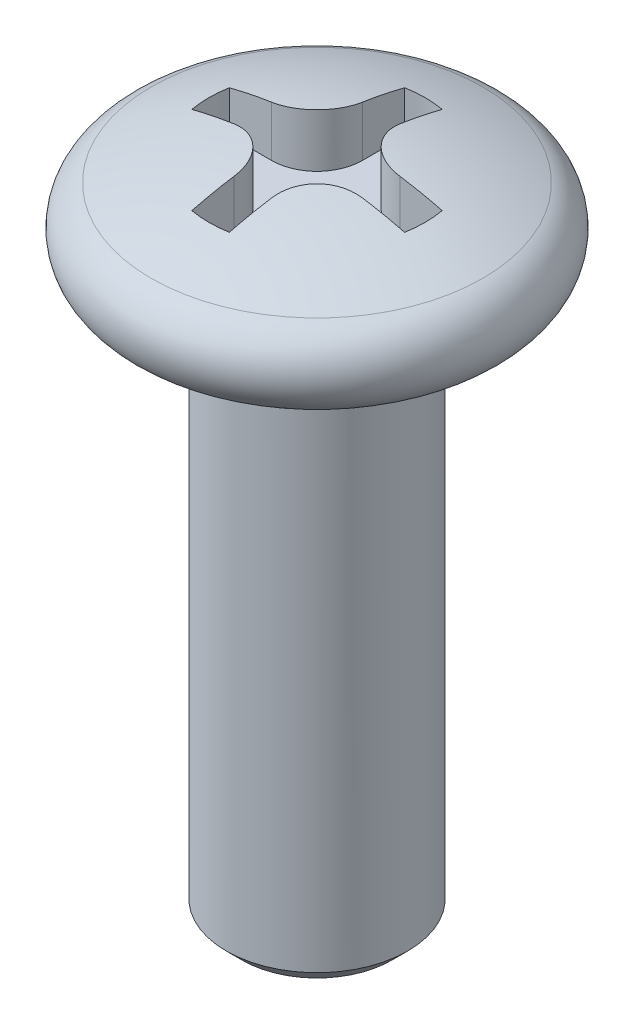
ISO-10303-21;
HEADER;
FILE_DESCRIPTION(('STEP AP214'),'2;1');
FILE_NAME('part.step','',(''),(''),'','','');
FILE_SCHEMA(('AUTOMOTIVE_DESIGN { 1 0 10303 214 1 1 1 1 }'));
ENDSEC;
DATA;
#1=APPLICATION_CONTEXT('core data for automotive mechanical design processes');
#2=APPLICATION_PROTOCOL_DEFINITION('international standard','automotive_design',2000,#1);
#3=PRODUCT_CONTEXT('',#1,'mechanical');
#4=PRODUCT('Part','Part','',(#3));
#5=PRODUCT_RELATED_PRODUCT_CATEGORY('part','',(#4));
#6=PRODUCT_DEFINITION_FORMATION('','',#4);
#7=PRODUCT_DEFINITION_CONTEXT('part definition',#1,'design');
#8=PRODUCT_DEFINITION('design','',#6,#7);
#9=PRODUCT_DEFINITION_SHAPE('','',#8);
#10=(LENGTH_UNIT() NAMED_UNIT(*) SI_UNIT(.MILLI.,.METRE.));
#11=(NAMED_UNIT(*) PLANE_ANGLE_UNIT() SI_UNIT($,.RADIAN.));
#12=(NAMED_UNIT(*) SI_UNIT($,.STERADIAN.) SOLID_ANGLE_UNIT());
#13=UNCERTAINTY_MEASURE_WITH_UNIT(LENGTH_MEASURE(1.E-05),#10,'distance_accuracy_value','');
#14=(GEOMETRIC_REPRESENTATION_CONTEXT(3) GLOBAL_UNCERTAINTY_ASSIGNED_CONTEXT((#13)) GLOBAL_UNIT_ASSIGNED_CONTEXT((#10,
#11,#12)) REPRESENTATION_CONTEXT('',''));
#15=CARTESIAN_POINT('',(0.,0.,0.));
#16=DIRECTION('',(0.,0.,1.));
#17=DIRECTION('',(1.,0.,0.));
#18=AXIS2_PLACEMENT_3D('',#15,#16,#17);
#19=CARTESIAN_POINT('',(0.,0.8,0.));
#20=DIRECTION('',(0.,-1.,0.));
#21=DIRECTION('',(0.,0.,-1.));
#22=AXIS2_PLACEMENT_3D('',#19,#20,#21);
#23=PLANE('',#22);
#24=DIRECTION('',(0.,0.,1.));
#25=VECTOR('',#24,1.);
#26=CARTESIAN_POINT('',(-0.2692388155425,0.8,1.526437178598));
#27=LINE('',#26,#25);
#28=CARTESIAN_POINT('',(-0.2692388155425,0.8,0.9192388155425));
#29=VERTEX_POINT('',#28);
#30=CARTESIAN_POINT('',(-0.2692388155425,0.8,1.52643732965034));
#31=VERTEX_POINT('',#30);
#32=EDGE_CURVE('E161',#29,#31,#27,.T.);
#33=ORIENTED_EDGE('',*,*,#32,.T.);
#34=CARTESIAN_POINT('',(0.,0.8,0.));
#35=DIRECTION('',(0.,-1.,0.));
#36=DIRECTION('',(0.,0.,-1.));
#37=AXIS2_PLACEMENT_3D('',#34,#35,#36);
#38=CIRCLE('',#37,1.55);
#39=CARTESIAN_POINT('',(0.269238815542473,0.8,1.52643717859769));
#40=VERTEX_POINT('',#39);
#41=EDGE_CURVE('E238',#31,#40,#38,.F.);
#42=ORIENTED_EDGE('',*,*,#41,.T.);
#43=DIRECTION('',(0.,0.,-1.));
#44=VECTOR('',#43,1.);
#45=CARTESIAN_POINT('',(0.2692388155425,0.8,0.9192388155425));
#46=LINE('',#45,#44);
#47=CARTESIAN_POINT('',(0.2692388155425,0.8,0.9192388155425));
#48=VERTEX_POINT('',#47);
#49=EDGE_CURVE('E165',#40,#48,#46,.T.);
#50=ORIENTED_EDGE('',*,*,#49,.T.);
#51=CARTESIAN_POINT('',(0.9192388155425,0.8,0.9192388155425));
#52=DIRECTION('',(0.,-1.,0.));
#53=DIRECTION('',(0.,0.,-1.));
#54=AXIS2_PLACEMENT_3D('',#51,#52,#53);
#55=CIRCLE('',#54,0.65);
#56=CARTESIAN_POINT('',(0.9192388155425,0.8,0.2692388155425));
#57=VERTEX_POINT('',#56);
#58=EDGE_CURVE('E168',#57,#48,#55,.F.);
#59=ORIENTED_EDGE('',*,*,#58,.F.);
#60=DIRECTION('',(1.,0.,0.));
#61=VECTOR('',#60,1.);
#62=CARTESIAN_POINT('',(1.526437178598,0.8,0.2692388155425));
#63=LINE('',#62,#61);
#64=CARTESIAN_POINT('',(1.52643725449384,0.8,0.2692388155425));
#65=VERTEX_POINT('',#64);
#66=EDGE_CURVE('E169',#57,#65,#63,.T.);
#67=ORIENTED_EDGE('',*,*,#66,.T.);
#68=CARTESIAN_POINT('',(0.,0.8,0.));
#69=DIRECTION('',(0.,-1.,0.));
#70=DIRECTION('',(0.,0.,-1.));
#71=AXIS2_PLACEMENT_3D('',#68,#69,#70);
#72=CIRCLE('',#71,1.55);
#73=CARTESIAN_POINT('',(1.52643717859769,0.8,-0.269238815542473));
#74=VERTEX_POINT('',#73);
#75=EDGE_CURVE('E249',#65,#74,#72,.F.);
#76=ORIENTED_EDGE('',*,*,#75,.T.);
#77=DIRECTION('',(-1.,0.,0.));
#78=VECTOR('',#77,1.);
#79=CARTESIAN_POINT('',(0.9192388155425,0.8,-0.2692388155425));
#80=LINE('',#79,#78);
#81=CARTESIAN_POINT('',(0.9192388155425,0.8,-0.2692388155425));
#82=VERTEX_POINT('',#81);
#83=EDGE_CURVE('E174',#74,#82,#80,.T.);
#84=ORIENTED_EDGE('',*,*,#83,.T.);
#85=CARTESIAN_POINT('',(0.9192388155425,0.8,-0.9192388155425));
#86=DIRECTION('',(0.,-1.,0.));
#87=DIRECTION('',(0.,0.,-1.));
#88=AXIS2_PLACEMENT_3D('',#85,#86,#87);
#89=CIRCLE('',#88,0.65);
#90=CARTESIAN_POINT('',(0.2692388155425,0.8,-0.9192388155425));
#91=VERTEX_POINT('',#90);
#92=EDGE_CURVE('E177',#91,#82,#89,.F.);
#93=ORIENTED_EDGE('',*,*,#92,.F.);
#94=DIRECTION('',(0.,0.,-1.));
#95=VECTOR('',#94,1.);
#96=CARTESIAN_POINT('',(0.2692388155425,0.8,-1.526437178598));
#97=LINE('',#96,#95);
#98=CARTESIAN_POINT('',(0.2692388155425,0.8,-1.52643732965034));
#99=VERTEX_POINT('',#98);
#100=EDGE_CURVE('E179',#91,#99,#97,.T.);
#101=ORIENTED_EDGE('',*,*,#100,.T.);
#102=CARTESIAN_POINT('',(0.,0.8,0.));
#103=DIRECTION('',(0.,-1.,0.));
#104=DIRECTION('',(0.,0.,-1.));
#105=AXIS2_PLACEMENT_3D('',#102,#103,#104);
#106=CIRCLE('',#105,1.55);
#107=CARTESIAN_POINT('',(-0.269238815542474,0.8,-1.52643717859769));
#108=VERTEX_POINT('',#107);
#109=EDGE_CURVE('E137',#99,#108,#106,.F.);
#110=ORIENTED_EDGE('',*,*,#109,.T.);
#111=DIRECTION('',(0.,0.,1.));
#112=VECTOR('',#111,1.);
#113=CARTESIAN_POINT('',(-0.2692388155425,0.8,-0.9192388155425));
#114=LINE('',#113,#112);
#115=CARTESIAN_POINT('',(-0.2692388155425,0.8,-0.9192388155425));
#116=VERTEX_POINT('',#115);
#117=EDGE_CURVE('E133',#108,#116,#114,.T.);
#118=ORIENTED_EDGE('',*,*,#117,.T.);
#119=CARTESIAN_POINT('',(-0.9192388155425,0.8,-0.9192388155425));
#120=DIRECTION('',(0.,-1.,0.));
#121=DIRECTION('',(0.,0.,-1.));
#122=AXIS2_PLACEMENT_3D('',#119,#120,#121);
#123=CIRCLE('',#122,0.65);
#124=CARTESIAN_POINT('',(-0.9192388155425,0.8,-0.2692388155425));
#125=VERTEX_POINT('',#124);
#126=EDGE_CURVE('E20',#125,#116,#123,.F.);
#127=ORIENTED_EDGE('',*,*,#126,.F.);
#128=DIRECTION('',(-1.,0.,0.));
#129=VECTOR('',#128,1.);
#130=CARTESIAN_POINT('',(-1.526437178598,0.8,-0.2692388155425));
#131=LINE('',#130,#129);
#132=CARTESIAN_POINT('',(-1.5264371785977,0.8,-0.269238815542425));
#133=VERTEX_POINT('',#132);
#134=EDGE_CURVE('E128',#125,#133,#131,.T.);
#135=ORIENTED_EDGE('',*,*,#134,.T.);
#136=CARTESIAN_POINT('',(0.,0.8,0.));
#137=DIRECTION('',(0.,-1.,0.));
#138=DIRECTION('',(0.,0.,-1.));
#139=AXIS2_PLACEMENT_3D('',#136,#137,#138);
#140=CIRCLE('',#139,1.55);
#141=CARTESIAN_POINT('',(-1.52643717859784,0.8,0.2692388155425));
#142=VERTEX_POINT('',#141);
#143=EDGE_CURVE('E246',#133,#142,#140,.F.);
#144=ORIENTED_EDGE('',*,*,#143,.T.);
#145=DIRECTION('',(1.,0.,0.));
#146=VECTOR('',#145,1.);
#147=CARTESIAN_POINT('',(-0.9192388155425,0.8,0.2692388155425));
#148=LINE('',#147,#146);
#149=CARTESIAN_POINT('',(-0.9192388155425,0.8,0.2692388155425));
#150=VERTEX_POINT('',#149);
#151=EDGE_CURVE('E158',#142,#150,#148,.T.);
#152=ORIENTED_EDGE('',*,*,#151,.T.);
#153=CARTESIAN_POINT('',(-0.9192388155425,0.8,0.9192388155425));
#154=DIRECTION('',(0.,-1.,0.));
#155=DIRECTION('',(0.,0.,-1.));
#156=AXIS2_PLACEMENT_3D('',#153,#154,#155);
#157=CIRCLE('',#156,0.65);
#158=EDGE_CURVE('E232',#29,#150,#157,.F.);
#159=ORIENTED_EDGE('',*,*,#158,.F.);
#160=EDGE_LOOP('',(#33,#42,#50,#59,#67,#76,#84,#93,#101,#110,#118,#127,#135,#144,#152,#159));
#161=FACE_BOUND('',#160,.T.);
#162=ADVANCED_FACE('F17',(#161),#23,.F.);
#163=CARTESIAN_POINT('',(-1.526437178598,0.8,-0.2692388155425));
#164=DIRECTION('',(0.,0.,-1.));
#165=DIRECTION('',(-1.,0.,0.));
#166=AXIS2_PLACEMENT_3D('',#163,#164,#165);
#167=PLANE('',#166);
#168=ORIENTED_EDGE('',*,*,#134,.F.);
#169=DIRECTION('',(0.,-1.,0.));
#170=VECTOR('',#169,1.);
#171=CARTESIAN_POINT('',(-0.9192388155425,0.8,-0.2692388155425));
#172=LINE('',#171,#170);
#173=CARTESIAN_POINT('',(-0.919238815542485,1.5247137721749,-0.269238815542501));
#174=VERTEX_POINT('',#173);
#175=EDGE_CURVE('E147',#174,#125,#172,.T.);
#176=ORIENTED_EDGE('',*,*,#175,.F.);
#177=CARTESIAN_POINT('',(-1.52643717859785,1.40083405534686,-0.269238815542502));
#178=CARTESIAN_POINT('',(-1.42628258533272,1.42660341497324,-0.269238815542501));
#179=CARTESIAN_POINT('',(-1.32560542511221,1.44981140452209,-0.2692388155425));
#180=CARTESIAN_POINT('',(-1.12320597076041,1.49110464346474,-0.2692388155425));
#181=CARTESIAN_POINT('',(-1.02148367662913,1.50918989285854,-0.269238815542501));
#182=CARTESIAN_POINT('',(-0.919238815542471,1.52471377217481,-0.269238815542503));
#183=B_SPLINE_CURVE_WITH_KNOTS('',3,(#177,#178,#179,#180,#181,#182),.UNSPECIFIED.,.F.,.F.,(4,2,
4),(0.,0.309952435577942,0.619904871155884),.UNSPECIFIED.);
#184=CARTESIAN_POINT('',(-1.52643717859778,1.40083405534693,-0.269238815542426));
#185=VERTEX_POINT('',#184);
#186=EDGE_CURVE('E229',#185,#174,#183,.T.);
#187=ORIENTED_EDGE('',*,*,#186,.F.);
#188=DIRECTION('',(0.,-1.,0.));
#189=VECTOR('',#188,1.);
#190=CARTESIAN_POINT('',(-1.52643717859772,0.8,-0.269238815542349));
#191=LINE('',#190,#189);
#192=EDGE_CURVE('E244',#185,#133,#191,.T.);
#193=ORIENTED_EDGE('',*,*,#192,.T.);
#194=EDGE_LOOP('',(#168,#176,#187,#193));
#195=FACE_BOUND('',#194,.T.);
#196=ADVANCED_FACE('F287',(#195),#167,.F.);
#197=CARTESIAN_POINT('',(-0.9192388155425,0.8,-0.9192388155425));
#198=DIRECTION('',(0.,-1.,0.));
#199=DIRECTION('',(0.,0.,-1.));
#200=AXIS2_PLACEMENT_3D('',#197,#198,#199);
#201=CYLINDRICAL_SURFACE('',#200,0.65);
#202=DIRECTION('',(0.,1.,0.));
#203=VECTOR('',#202,1.);
#204=CARTESIAN_POINT('',(-0.2692388155425,0.8,-0.9192388155425));
#205=LINE('',#204,#203);
#206=CARTESIAN_POINT('',(-0.269238815542499,1.5247137721749,-0.9192388155425));
#207=VERTEX_POINT('',#206);
#208=EDGE_CURVE('E141',#116,#207,#205,.T.);
#209=ORIENTED_EDGE('',*,*,#208,.T.);
#210=CARTESIAN_POINT('',(-0.919238815542471,1.52471377217481,-0.269238815542502));
#211=CARTESIAN_POINT('',(-0.883271069284547,1.53017838215662,-0.269206596368221));
#212=CARTESIAN_POINT('',(-0.847230957030022,1.53518398680924,-0.272222835690411));
#213=CARTESIAN_POINT('',(-0.776024482266567,1.54415362187526,-0.284194183766013));
#214=CARTESIAN_POINT('',(-0.740857976412674,1.5481178242021,-0.293148311438722));
#215=CARTESIAN_POINT('',(-0.67237147630745,1.55488625546089,-0.316848960302737));
#216=CARTESIAN_POINT('',(-0.639053304502208,1.55768935656103,-0.331601086387425));
#217=CARTESIAN_POINT('',(-0.575297778798748,1.56204492956572,-0.366496760027211));
#218=CARTESIAN_POINT('',(-0.544859240050173,1.56359791783258,-0.386638076978003));
#219=CARTESIAN_POINT('',(-0.488097063461274,1.56539571440067,-0.431479043245953));
#220=CARTESIAN_POINT('',(-0.46172860298219,1.56565593228317,-0.456121349806758));
#221=CARTESIAN_POINT('',(-0.413435525795813,1.56490196217992,-0.509414647326526));
#222=CARTESIAN_POINT('',(-0.391510799474461,1.56388780563375,-0.538065539375813));
#223=CARTESIAN_POINT('',(-0.352825154531402,1.56062536432746,-0.598376464130783));
#224=CARTESIAN_POINT('',(-0.33603703253758,1.55838376285363,-0.630019440211363));
#225=CARTESIAN_POINT('',(-0.307904881496572,1.55273696196925,-0.69554063304805));
#226=CARTESIAN_POINT('',(-0.296559537832556,1.54933204387991,-0.729418307797173));
#227=CARTESIAN_POINT('',(-0.281799832125994,1.54249219211062,-0.789390970708275));
#228=CARTESIAN_POINT('',(-0.277087023520738,1.53929822937966,-0.815202930682549));
#229=CARTESIAN_POINT('',(-0.270805742102409,1.53238664939424,-0.867099473917435));
#230=CARTESIAN_POINT('',(-0.269232761212042,1.52866979112439,-0.893183612184108));
#231=CARTESIAN_POINT('',(-0.269238815542499,1.5247137721748,-0.919238815542471));
#232=B_SPLINE_CURVE_WITH_KNOTS('',3,(#210,#211,#212,#213,#214,#215,#216,#217,#218,#219,#220,
#221,#222,#223,#224,#225,#226,#227,#228,#229,#230,#231),.UNSPECIFIED.,.F.,.F.,(4,2,2,2,2,2,2,2,
2,2,4),(0.,0.109017930799935,0.218017853725243,0.327123406477721,0.436183869743588,
0.543941180487167,0.651695832846214,0.758869525629321,0.866017319256542,0.945129051904781,
1.02412711619082),.UNSPECIFIED.);
#233=EDGE_CURVE('E271',#174,#207,#232,.T.);
#234=ORIENTED_EDGE('',*,*,#233,.F.);
#235=ORIENTED_EDGE('',*,*,#175,.T.);
#236=ORIENTED_EDGE('',*,*,#126,.T.);
#237=EDGE_LOOP('',(#209,#234,#235,#236));
#238=FACE_BOUND('',#237,.T.);
#239=ADVANCED_FACE('F144',(#238),#201,.T.);
#240=CARTESIAN_POINT('',(-0.2692388155425,0.8,-0.9192388155425));
#241=DIRECTION('',(-1.,0.,0.));
#242=DIRECTION('',(0.,0.,1.));
#243=AXIS2_PLACEMENT_3D('',#240,#241,#242);
#244=PLANE('',#243);
#245=ORIENTED_EDGE('',*,*,#117,.F.);
#246=DIRECTION('',(0.,-1.,0.));
#247=VECTOR('',#246,1.);
#248=CARTESIAN_POINT('',(-0.269238815542447,0.8,-1.5264371785977));
#249=LINE('',#248,#247);
#250=CARTESIAN_POINT('',(-0.269238815542499,1.40083405534695,-1.5264371785976));
#251=VERTEX_POINT('',#250);
#252=EDGE_CURVE('E153',#108,#251,#249,.F.);
#253=ORIENTED_EDGE('',*,*,#252,.T.);
#254=CARTESIAN_POINT('',(-0.269238815542499,-4.530985590341,0.));
#255=DIRECTION('',(-1.,0.,0.));
#256=DIRECTION('',(0.,0.,1.));
#257=AXIS2_PLACEMENT_3D('',#254,#255,#256);
#258=CIRCLE('',#257,6.12507100115372);
#259=EDGE_CURVE('E150',#207,#251,#258,.T.);
#260=ORIENTED_EDGE('',*,*,#259,.F.);
#261=ORIENTED_EDGE('',*,*,#208,.F.);
#262=EDGE_LOOP('',(#245,#253,#260,#261));
#263=FACE_BOUND('',#262,.T.);
#264=ADVANCED_FACE('F148',(#263),#244,.F.);
#265=CARTESIAN_POINT('',(0.,0.8,0.));
#266=DIRECTION('',(0.,-1.,0.));
#267=DIRECTION('',(0.,0.,-1.));
#268=AXIS2_PLACEMENT_3D('',#265,#266,#267);
#269=CYLINDRICAL_SURFACE('',#268,1.55);
#270=ORIENTED_EDGE('',*,*,#109,.F.);
#271=DIRECTION('',(0.,1.,0.));
#272=VECTOR('',#271,1.);
#273=CARTESIAN_POINT('',(0.2692388155425,0.8,-1.526437480703));
#274=LINE('',#273,#272);
#275=CARTESIAN_POINT('',(0.2692388155425,1.40083401647652,-1.52643732965025));
#276=VERTEX_POINT('',#275);
#277=EDGE_CURVE('E180',#99,#276,#274,.T.);
#278=ORIENTED_EDGE('',*,*,#277,.T.);
#279=CARTESIAN_POINT('',(0.,1.400834055347,0.));
#280=DIRECTION('',(0.,-1.,0.));
#281=DIRECTION('',(0.,0.,-1.));
#282=AXIS2_PLACEMENT_3D('',#279,#280,#281);
#283=CIRCLE('',#282,1.55);
#284=EDGE_CURVE('E259',#251,#276,#283,.T.);
#285=ORIENTED_EDGE('',*,*,#284,.F.);
#286=ORIENTED_EDGE('',*,*,#252,.F.);
#287=EDGE_LOOP('',(#270,#278,#285,#286));
#288=FACE_BOUND('',#287,.T.);
#289=ADVANCED_FACE('F257',(#288),#269,.F.);
#290=CARTESIAN_POINT('',(0.2692388155425,0.8,-1.526437178598));
#291=DIRECTION('',(1.,0.,0.));
#292=DIRECTION('',(0.,0.,-1.));
#293=AXIS2_PLACEMENT_3D('',#290,#291,#292);
#294=PLANE('',#293);
#295=ORIENTED_EDGE('',*,*,#100,.F.);
#296=DIRECTION('',(0.,-1.,0.));
#297=VECTOR('',#296,1.);
#298=CARTESIAN_POINT('',(0.2692388155425,0.8,-0.9192388155425));
#299=LINE('',#298,#297);
#300=CARTESIAN_POINT('',(0.2692388155425,1.5247137721749,-0.9192388155425));
#301=VERTEX_POINT('',#300);
#302=EDGE_CURVE('E251',#301,#91,#299,.T.);
#303=ORIENTED_EDGE('',*,*,#302,.F.);
#304=CARTESIAN_POINT('',(0.2692388155425,-4.530985590341,0.));
#305=DIRECTION('',(-1.,0.,0.));
#306=DIRECTION('',(0.,0.,1.));
#307=AXIS2_PLACEMENT_3D('',#304,#305,#306);
#308=CIRCLE('',#307,6.12507100115372);
#309=EDGE_CURVE('E262',#276,#301,#308,.F.);
#310=ORIENTED_EDGE('',*,*,#309,.F.);
#311=ORIENTED_EDGE('',*,*,#277,.F.);
#312=EDGE_LOOP('',(#295,#303,#310,#311));
#313=FACE_BOUND('',#312,.T.);
#314=ADVANCED_FACE('F263',(#313),#294,.F.);
#315=CARTESIAN_POINT('',(0.9192388155425,0.8,-0.9192388155425));
#316=DIRECTION('',(0.,-1.,0.));
#317=DIRECTION('',(0.,0.,-1.));
#318=AXIS2_PLACEMENT_3D('',#315,#316,#317);
#319=CYLINDRICAL_SURFACE('',#318,0.65);
#320=DIRECTION('',(0.,1.,0.));
#321=VECTOR('',#320,1.);
#322=CARTESIAN_POINT('',(0.9192388155425,0.8,-0.2692388155425));
#323=LINE('',#322,#321);
#324=CARTESIAN_POINT('',(0.919238815542485,1.5247137721749,-0.269238815542501));
#325=VERTEX_POINT('',#324);
#326=EDGE_CURVE('E176',#82,#325,#323,.T.);
#327=ORIENTED_EDGE('',*,*,#326,.T.);
#328=CARTESIAN_POINT('',(0.2692388155425,1.5247137721748,-0.919238815542471));
#329=CARTESIAN_POINT('',(0.26920659636822,1.53017838215662,-0.883271069284549));
#330=CARTESIAN_POINT('',(0.27222283569041,1.53518398680924,-0.847230957030025));
#331=CARTESIAN_POINT('',(0.284194183766012,1.54415362187526,-0.776024482266574));
#332=CARTESIAN_POINT('',(0.29314831143872,1.5481178242021,-0.740857976412682));
#333=CARTESIAN_POINT('',(0.316848960302734,1.55488625546089,-0.672371476307461));
#334=CARTESIAN_POINT('',(0.33160108638742,1.55768935656103,-0.63905330450222));
#335=CARTESIAN_POINT('',(0.366496760027202,1.56204492956572,-0.575297778798761));
#336=CARTESIAN_POINT('',(0.386638076977991,1.56359791783258,-0.544859240050187));
#337=CARTESIAN_POINT('',(0.431479043245938,1.56539571440067,-0.488097063461288));
#338=CARTESIAN_POINT('',(0.456121349806743,1.56565593228317,-0.461728602982204));
#339=CARTESIAN_POINT('',(0.509414647326511,1.56490196217992,-0.413435525795826));
#340=CARTESIAN_POINT('',(0.538065539375799,1.56388780563376,-0.391510799474473));
#341=CARTESIAN_POINT('',(0.598376464130768,1.56062536432746,-0.352825154531412));
#342=CARTESIAN_POINT('',(0.630019440211347,1.55838376285363,-0.336037032537589));
#343=CARTESIAN_POINT('',(0.695540633048032,1.55273696196925,-0.307904881496577));
#344=CARTESIAN_POINT('',(0.729418307797154,1.54933204387992,-0.296559537832559));
#345=CARTESIAN_POINT('',(0.789390970708259,1.54249219211062,-0.281799832125995));
#346=CARTESIAN_POINT('',(0.815202930682536,1.53929822937967,-0.277087023520739));
#347=CARTESIAN_POINT('',(0.867099473917428,1.53238664939424,-0.270805742102411));
#348=CARTESIAN_POINT('',(0.893183612184104,1.52866979112439,-0.269232761212043));
#349=CARTESIAN_POINT('',(0.91923881554247,1.52471377217481,-0.269238815542501));
#350=B_SPLINE_CURVE_WITH_KNOTS('',3,(#328,#329,#330,#331,#332,#333,#334,#335,#336,#337,#338,
#339,#340,#341,#342,#343,#344,#345,#346,#347,#348,#349),.UNSPECIFIED.,.F.,.F.,(4,2,2,2,2,2,2,2,
2,2,4),(0.,0.10901793079993,0.218017853725233,0.327123406477707,0.436183869743568,
0.543941180487147,0.651695832846195,0.758869525629303,0.866017319256523,0.945129051904771,
1.02412711619082),.UNSPECIFIED.);
#351=EDGE_CURVE('E267',#301,#325,#350,.T.);
#352=ORIENTED_EDGE('',*,*,#351,.F.);
#353=ORIENTED_EDGE('',*,*,#302,.T.);
#354=ORIENTED_EDGE('',*,*,#92,.T.);
#355=EDGE_LOOP('',(#327,#352,#353,#354));
#356=FACE_BOUND('',#355,.T.);
#357=ADVANCED_FACE('F406',(#356),#319,.T.);
#358=CARTESIAN_POINT('',(0.9192388155425,0.8,-0.2692388155425));
#359=DIRECTION('',(0.,0.,-1.));
#360=DIRECTION('',(-1.,0.,0.));
#361=AXIS2_PLACEMENT_3D('',#358,#359,#360);
#362=PLANE('',#361);
#363=ORIENTED_EDGE('',*,*,#83,.F.);
#364=DIRECTION('',(0.,-1.,0.));
#365=VECTOR('',#364,1.);
#366=CARTESIAN_POINT('',(1.5264371785977,0.8,-0.269238815542447));
#367=LINE('',#366,#365);
#368=CARTESIAN_POINT('',(1.52643717859769,1.400834055347,-0.269238815542473));
#369=VERTEX_POINT('',#368);
#370=EDGE_CURVE('E173',#74,#369,#367,.F.);
#371=ORIENTED_EDGE('',*,*,#370,.T.);
#372=CARTESIAN_POINT('',(0.91923881554247,1.52471377217481,-0.269238815542502));
#373=CARTESIAN_POINT('',(1.02148367662913,1.50918989285854,-0.269238815542501));
#374=CARTESIAN_POINT('',(1.12320597076041,1.49110464346474,-0.2692388155425));
#375=CARTESIAN_POINT('',(1.3256054251122,1.44981140452209,-0.2692388155425));
#376=CARTESIAN_POINT('',(1.42628258533271,1.42660341497324,-0.269238815542501));
#377=CARTESIAN_POINT('',(1.52643717859784,1.40083405534686,-0.269238815542503));
#378=B_SPLINE_CURVE_WITH_KNOTS('',3,(#372,#373,#374,#375,#376,#377),.UNSPECIFIED.,.F.,.F.,(4,2,
4),(0.,0.309952435577938,0.619904871155877),.UNSPECIFIED.);
#379=EDGE_CURVE('E512',#325,#369,#378,.T.);
#380=ORIENTED_EDGE('',*,*,#379,.F.);
#381=ORIENTED_EDGE('',*,*,#326,.F.);
#382=EDGE_LOOP('',(#363,#371,#380,#381));
#383=FACE_BOUND('',#382,.T.);
#384=ADVANCED_FACE('F398',(#383),#362,.F.);
#385=CARTESIAN_POINT('',(0.,0.8,0.));
#386=DIRECTION('',(0.,-1.,0.));
#387=DIRECTION('',(0.,0.,-1.));
#388=AXIS2_PLACEMENT_3D('',#385,#386,#387);
#389=CYLINDRICAL_SURFACE('',#388,1.55);
#390=ORIENTED_EDGE('',*,*,#143,.F.);
#391=ORIENTED_EDGE('',*,*,#192,.F.);
#392=CARTESIAN_POINT('',(0.,1.400834055347,0.));
#393=DIRECTION('',(0.,-1.,0.));
#394=DIRECTION('',(0.,0.,-1.));
#395=AXIS2_PLACEMENT_3D('',#392,#393,#394);
#396=CIRCLE('',#395,1.55);
#397=CARTESIAN_POINT('',(-1.52643717859784,1.400834055347,0.2692388155425));
#398=VERTEX_POINT('',#397);
#399=EDGE_CURVE('E518',#398,#185,#396,.T.);
#400=ORIENTED_EDGE('',*,*,#399,.F.);
#401=DIRECTION('',(0.,1.,0.));
#402=VECTOR('',#401,1.);
#403=CARTESIAN_POINT('',(-1.526437178598,0.8,0.2692388155425));
#404=LINE('',#403,#402);
#405=EDGE_CURVE('E160',#398,#142,#404,.F.);
#406=ORIENTED_EDGE('',*,*,#405,.T.);
#407=EDGE_LOOP('',(#390,#391,#400,#406));
#408=FACE_BOUND('',#407,.T.);
#409=ADVANCED_FACE('F390',(#408),#389,.F.);
#410=CARTESIAN_POINT('',(0.,0.8,0.));
#411=DIRECTION('',(0.,-1.,0.));
#412=DIRECTION('',(0.,0.,-1.));
#413=AXIS2_PLACEMENT_3D('',#410,#411,#412);
#414=CYLINDRICAL_SURFACE('',#413,1.55);
#415=ORIENTED_EDGE('',*,*,#370,.F.);
#416=ORIENTED_EDGE('',*,*,#75,.F.);
#417=DIRECTION('',(0.,1.,0.));
#418=VECTOR('',#417,1.);
#419=CARTESIAN_POINT('',(1.52643733039,0.8,0.2692388155425));
#420=LINE('',#419,#418);
#421=CARTESIAN_POINT('',(1.52643725449395,1.40083405534692,0.2692388155425));
#422=VERTEX_POINT('',#421);
#423=EDGE_CURVE('E172',#65,#422,#420,.T.);
#424=ORIENTED_EDGE('',*,*,#423,.T.);
#425=CARTESIAN_POINT('',(0.,1.400834055347,0.));
#426=DIRECTION('',(0.,-1.,0.));
#427=DIRECTION('',(0.,0.,-1.));
#428=AXIS2_PLACEMENT_3D('',#425,#426,#427);
#429=CIRCLE('',#428,1.55);
#430=EDGE_CURVE('E520',#369,#422,#429,.T.);
#431=ORIENTED_EDGE('',*,*,#430,.F.);
#432=EDGE_LOOP('',(#415,#416,#424,#431));
#433=FACE_BOUND('',#432,.T.);
#434=ADVANCED_FACE('F382',(#433),#414,.F.);
#435=CARTESIAN_POINT('',(1.526437178598,0.8,0.2692388155425));
#436=DIRECTION('',(0.,0.,1.));
#437=DIRECTION('',(1.,0.,0.));
#438=AXIS2_PLACEMENT_3D('',#435,#436,#437);
#439=PLANE('',#438);
#440=ORIENTED_EDGE('',*,*,#66,.F.);
#441=DIRECTION('',(0.,-1.,0.));
#442=VECTOR('',#441,1.);
#443=CARTESIAN_POINT('',(0.9192388155425,0.8,0.2692388155425));
#444=LINE('',#443,#442);
#445=CARTESIAN_POINT('',(0.919238815542485,1.5247137721749,0.2692388155425));
#446=VERTEX_POINT('',#445);
#447=EDGE_CURVE('E240',#446,#57,#444,.T.);
#448=ORIENTED_EDGE('',*,*,#447,.F.);
#449=CARTESIAN_POINT('',(1.5264371785979,1.40083405534685,0.269238815542499));
#450=CARTESIAN_POINT('',(1.42628258533276,1.42660341497323,0.269238815542499));
#451=CARTESIAN_POINT('',(1.32560542511224,1.44981140452209,0.2692388155425));
#452=CARTESIAN_POINT('',(1.12320597076043,1.49110464346474,0.2692388155425));
#453=CARTESIAN_POINT('',(1.02148367662914,1.50918989285854,0.269238815542501));
#454=CARTESIAN_POINT('',(0.919238815542471,1.52471377217481,0.269238815542501));
#455=B_SPLINE_CURVE_WITH_KNOTS('',3,(#449,#450,#451,#452,#453,#454),.UNSPECIFIED.,.F.,.F.,(4,2,
4),(0.,0.309952435577968,0.619904871155937),.UNSPECIFIED.);
#456=EDGE_CURVE('E522',#422,#446,#455,.T.);
#457=ORIENTED_EDGE('',*,*,#456,.F.);
#458=ORIENTED_EDGE('',*,*,#423,.F.);
#459=EDGE_LOOP('',(#440,#448,#457,#458));
#460=FACE_BOUND('',#459,.T.);
#461=ADVANCED_FACE('F374',(#460),#439,.F.);
#462=CARTESIAN_POINT('',(0.9192388155425,0.8,0.9192388155425));
#463=DIRECTION('',(0.,-1.,0.));
#464=DIRECTION('',(0.,0.,-1.));
#465=AXIS2_PLACEMENT_3D('',#462,#463,#464);
#466=CYLINDRICAL_SURFACE('',#465,0.65);
#467=DIRECTION('',(0.,1.,0.));
#468=VECTOR('',#467,1.);
#469=CARTESIAN_POINT('',(0.2692388155425,0.8,0.9192388155425));
#470=LINE('',#469,#468);
#471=CARTESIAN_POINT('',(0.2692388155425,1.5247137721749,0.919238815542486));
#472=VERTEX_POINT('',#471);
#473=EDGE_CURVE('E167',#48,#472,#470,.T.);
#474=ORIENTED_EDGE('',*,*,#473,.T.);
#475=CARTESIAN_POINT('',(0.919238815542471,1.52471377217481,0.269238815542501));
#476=CARTESIAN_POINT('',(0.88327106928455,1.53017838215662,0.26920659636822));
#477=CARTESIAN_POINT('',(0.847230957030028,1.53518398680924,0.27222283569041));
#478=CARTESIAN_POINT('',(0.776024482266579,1.54415362187526,0.284194183766011));
#479=CARTESIAN_POINT('',(0.740857976412689,1.5481178242021,0.293148311438719));
#480=CARTESIAN_POINT('',(0.672371476307471,1.55488625546089,0.31684896030273));
#481=CARTESIAN_POINT('',(0.639053304502231,1.55768935656103,0.331601086387414));
#482=CARTESIAN_POINT('',(0.575297778798774,1.56204492956572,0.366496760027194));
#483=CARTESIAN_POINT('',(0.544859240050202,1.56359791783258,0.386638076977983));
#484=CARTESIAN_POINT('',(0.488097063461302,1.56539571440067,0.431479043245928));
#485=CARTESIAN_POINT('',(0.461728602982216,1.56565593228317,0.456121349806731));
#486=CARTESIAN_POINT('',(0.413435525795836,1.56490196217992,0.509414647326497));
#487=CARTESIAN_POINT('',(0.391510799474484,1.56388780563376,0.538065539375785));
#488=CARTESIAN_POINT('',(0.352825154531421,1.56062536432746,0.598376464130753));
#489=CARTESIAN_POINT('',(0.336037032537596,1.55838376285363,0.630019440211331));
#490=CARTESIAN_POINT('',(0.307904881496584,1.55273696196925,0.695540633048016));
#491=CARTESIAN_POINT('',(0.296559537832567,1.54933204387992,0.729418307797139));
#492=CARTESIAN_POINT('',(0.281799832126,1.54249219211062,0.789390970708247));
#493=CARTESIAN_POINT('',(0.277087023520742,1.53929822937967,0.815202930682527));
#494=CARTESIAN_POINT('',(0.27080574210241,1.53238664939424,0.867099473917423));
#495=CARTESIAN_POINT('',(0.269232761212041,1.52866979112439,0.893183612184102));
#496=CARTESIAN_POINT('',(0.269238815542501,1.52471377217481,0.919238815542471));
#497=B_SPLINE_CURVE_WITH_KNOTS('',3,(#475,#476,#477,#478,#479,#480,#481,#482,#483,#484,#485,
#486,#487,#488,#489,#490,#491,#492,#493,#494,#495,#496),.UNSPECIFIED.,.F.,.F.,(4,2,2,2,2,2,2,2,
2,2,4),(0.,0.109017930799925,0.218017853725224,0.327123406477693,0.43618386974355,
0.543941180487129,0.651695832846177,0.758869525629285,0.866017319256506,0.945129051904763,
1.02412711619082),.UNSPECIFIED.);
#498=EDGE_CURVE('E528',#446,#472,#497,.T.);
#499=ORIENTED_EDGE('',*,*,#498,.F.);
#500=ORIENTED_EDGE('',*,*,#447,.T.);
#501=ORIENTED_EDGE('',*,*,#58,.T.);
#502=EDGE_LOOP('',(#474,#499,#500,#501));
#503=FACE_BOUND('',#502,.T.);
#504=ADVANCED_FACE('F366',(#503),#466,.T.);
#505=CARTESIAN_POINT('',(0.2692388155425,0.8,0.9192388155425));
#506=DIRECTION('',(1.,0.,0.));
#507=DIRECTION('',(0.,0.,-1.));
#508=AXIS2_PLACEMENT_3D('',#505,#506,#507);
#509=PLANE('',#508);
#510=ORIENTED_EDGE('',*,*,#49,.F.);
#511=DIRECTION('',(0.,-1.,0.));
#512=VECTOR('',#511,1.);
#513=CARTESIAN_POINT('',(0.269238815542447,0.8,1.5264371785977));
#514=LINE('',#513,#512);
#515=CARTESIAN_POINT('',(0.269238815542473,1.400834055347,1.52643717859769));
#516=VERTEX_POINT('',#515);
#517=EDGE_CURVE('E164',#40,#516,#514,.F.);
#518=ORIENTED_EDGE('',*,*,#517,.T.);
#519=CARTESIAN_POINT('',(0.269238815542501,1.52471377217481,0.919238815542471));
#520=CARTESIAN_POINT('',(0.269238815542502,1.50918989285854,1.02148367662913));
#521=CARTESIAN_POINT('',(0.269238815542502,1.49110464346474,1.12320597076041));
#522=CARTESIAN_POINT('',(0.269238815542498,1.44981140452209,1.3256054251122));
#523=CARTESIAN_POINT('',(0.269238815542496,1.42660341497324,1.42628258533271));
#524=CARTESIAN_POINT('',(0.269238815542491,1.40083405534687,1.52643717859784));
#525=B_SPLINE_CURVE_WITH_KNOTS('',3,(#519,#520,#521,#522,#523,#524),.UNSPECIFIED.,.F.,.F.,(4,2,
4),(0.,0.309952435577937,0.619904871155875),.UNSPECIFIED.);
#526=EDGE_CURVE('E536',#472,#516,#525,.T.);
#527=ORIENTED_EDGE('',*,*,#526,.F.);
#528=ORIENTED_EDGE('',*,*,#473,.F.);
#529=EDGE_LOOP('',(#510,#518,#527,#528));
#530=FACE_BOUND('',#529,.T.);
#531=ADVANCED_FACE('F358',(#530),#509,.F.);
#532=CARTESIAN_POINT('',(0.,0.8,0.));
#533=DIRECTION('',(0.,-1.,0.));
#534=DIRECTION('',(0.,0.,-1.));
#535=AXIS2_PLACEMENT_3D('',#532,#533,#534);
#536=CYLINDRICAL_SURFACE('',#535,1.55);
#537=ORIENTED_EDGE('',*,*,#41,.F.);
#538=DIRECTION('',(0.,1.,0.));
#539=VECTOR('',#538,1.);
#540=CARTESIAN_POINT('',(-0.2692388155425,0.8,1.526437480703));
#541=LINE('',#540,#539);
#542=CARTESIAN_POINT('',(-0.2692388155425,1.40083405534692,1.52643732965045));
#543=VERTEX_POINT('',#542);
#544=EDGE_CURVE('E163',#31,#543,#541,.T.);
#545=ORIENTED_EDGE('',*,*,#544,.T.);
#546=CARTESIAN_POINT('',(0.,1.400834055347,0.));
#547=DIRECTION('',(0.,-1.,0.));
#548=DIRECTION('',(0.,0.,-1.));
#549=AXIS2_PLACEMENT_3D('',#546,#547,#548);
#550=CIRCLE('',#549,1.55);
#551=EDGE_CURVE('E542',#516,#543,#550,.T.);
#552=ORIENTED_EDGE('',*,*,#551,.F.);
#553=ORIENTED_EDGE('',*,*,#517,.F.);
#554=EDGE_LOOP('',(#537,#545,#552,#553));
#555=FACE_BOUND('',#554,.T.);
#556=ADVANCED_FACE('F350',(#555),#536,.F.);
#557=CARTESIAN_POINT('',(-0.2692388155425,0.8,1.526437178598));
#558=DIRECTION('',(-1.,0.,0.));
#559=DIRECTION('',(0.,0.,1.));
#560=AXIS2_PLACEMENT_3D('',#557,#558,#559);
#561=PLANE('',#560);
#562=ORIENTED_EDGE('',*,*,#32,.F.);
#563=DIRECTION('',(0.,-1.,0.));
#564=VECTOR('',#563,1.);
#565=CARTESIAN_POINT('',(-0.2692388155425,0.8,0.9192388155425));
#566=LINE('',#565,#564);
#567=CARTESIAN_POINT('',(-0.2692388155425,1.5247137721749,0.919238815542485));
#568=VERTEX_POINT('',#567);
#569=EDGE_CURVE('E233',#568,#29,#566,.T.);
#570=ORIENTED_EDGE('',*,*,#569,.F.);
#571=CARTESIAN_POINT('',(-0.2692388155425,1.40083405534685,1.5264371785979));
#572=CARTESIAN_POINT('',(-0.2692388155425,1.42660341497323,1.42628258533276));
#573=CARTESIAN_POINT('',(-0.2692388155425,1.44981140452209,1.32560542511224));
#574=CARTESIAN_POINT('',(-0.2692388155425,1.49110464346474,1.12320597076043));
#575=CARTESIAN_POINT('',(-0.269238815542501,1.50918989285854,1.02148367662914));
#576=CARTESIAN_POINT('',(-0.269238815542502,1.5247137721748,0.919238815542469));
#577=B_SPLINE_CURVE_WITH_KNOTS('',3,(#571,#572,#573,#574,#575,#576),.UNSPECIFIED.,.F.,.F.,(4,2,
4),(0.,0.309952435577969,0.619904871155938),.UNSPECIFIED.);
#578=EDGE_CURVE('E544',#543,#568,#577,.T.);
#579=ORIENTED_EDGE('',*,*,#578,.F.);
#580=ORIENTED_EDGE('',*,*,#544,.F.);
#581=EDGE_LOOP('',(#562,#570,#579,#580));
#582=FACE_BOUND('',#581,.T.);
#583=ADVANCED_FACE('F344',(#582),#561,.F.);
#584=CARTESIAN_POINT('',(-0.9192388155425,0.8,0.9192388155425));
#585=DIRECTION('',(0.,-1.,0.));
#586=DIRECTION('',(0.,0.,-1.));
#587=AXIS2_PLACEMENT_3D('',#584,#585,#586);
#588=CYLINDRICAL_SURFACE('',#587,0.65);
#589=DIRECTION('',(0.,1.,0.));
#590=VECTOR('',#589,1.);
#591=CARTESIAN_POINT('',(-0.9192388155425,0.8,0.2692388155425));
#592=LINE('',#591,#590);
#593=CARTESIAN_POINT('',(-0.919238815542485,1.5247137721749,0.269238815542501));
#594=VERTEX_POINT('',#593);
#595=EDGE_CURVE('E35',#150,#594,#592,.T.);
#596=ORIENTED_EDGE('',*,*,#595,.T.);
#597=CARTESIAN_POINT('',(-0.2692388155425,1.5247137721748,0.919238815542471));
#598=CARTESIAN_POINT('',(-0.26920659636822,1.53017838215662,0.88327106928455));
#599=CARTESIAN_POINT('',(-0.27222283569041,1.53518398680924,0.847230957030028));
#600=CARTESIAN_POINT('',(-0.284194183766011,1.54415362187526,0.776024482266578));
#601=CARTESIAN_POINT('',(-0.293148311438719,1.5481178242021,0.740857976412687));
#602=CARTESIAN_POINT('',(-0.316848960302731,1.55488625546089,0.672371476307467));
#603=CARTESIAN_POINT('',(-0.331601086387417,1.55768935656103,0.639053304502226));
#604=CARTESIAN_POINT('',(-0.366496760027198,1.56204492956572,0.575297778798768));
#605=CARTESIAN_POINT('',(-0.386638076977987,1.56359791783258,0.544859240050195));
#606=CARTESIAN_POINT('',(-0.431479043245933,1.56539571440067,0.488097063461295));
#607=CARTESIAN_POINT('',(-0.456121349806737,1.56565593228317,0.46172860298221));
#608=CARTESIAN_POINT('',(-0.509414647326505,1.56490196217992,0.413435525795831));
#609=CARTESIAN_POINT('',(-0.538065539375792,1.56388780563376,0.391510799474478));
#610=CARTESIAN_POINT('',(-0.598376464130761,1.56062536432746,0.352825154531416));
#611=CARTESIAN_POINT('',(-0.630019440211339,1.55838376285363,0.336037032537591));
#612=CARTESIAN_POINT('',(-0.695540633048025,1.55273696196925,0.307904881496581));
#613=CARTESIAN_POINT('',(-0.729418307797148,1.54933204387992,0.296559537832564));
#614=CARTESIAN_POINT('',(-0.789390970708254,1.54249219211062,0.281799832125999));
#615=CARTESIAN_POINT('',(-0.815202930682532,1.53929822937967,0.277087023520741));
#616=CARTESIAN_POINT('',(-0.867099473917425,1.53238664939424,0.270805742102409));
#617=CARTESIAN_POINT('',(-0.893183612184102,1.52866979112439,0.269232761212041));
#618=CARTESIAN_POINT('',(-0.91923881554247,1.5247137721748,0.269238815542501));
#619=B_SPLINE_CURVE_WITH_KNOTS('',3,(#597,#598,#599,#600,#601,#602,#603,#604,#605,#606,#607,
#608,#609,#610,#611,#612,#613,#614,#615,#616,#617,#618),.UNSPECIFIED.,.F.,.F.,(4,2,2,2,2,2,2,2,
2,2,4),(0.,0.109017930799928,0.218017853725229,0.3271234064777,0.43618386974356,
0.543941180487139,0.651695832846188,0.758869525629295,0.866017319256516,0.945129051904768,
1.02412711619082),.UNSPECIFIED.);
#620=EDGE_CURVE('E201',#568,#594,#619,.T.);
#621=ORIENTED_EDGE('',*,*,#620,.F.);
#622=ORIENTED_EDGE('',*,*,#569,.T.);
#623=ORIENTED_EDGE('',*,*,#158,.T.);
#624=EDGE_LOOP('',(#596,#621,#622,#623));
#625=FACE_BOUND('',#624,.T.);
#626=ADVANCED_FACE('F337',(#625),#588,.T.);
#627=CARTESIAN_POINT('',(-0.9192388155425,0.8,0.2692388155425));
#628=DIRECTION('',(0.,0.,1.));
#629=DIRECTION('',(1.,0.,0.));
#630=AXIS2_PLACEMENT_3D('',#627,#628,#629);
#631=PLANE('',#630);
#632=ORIENTED_EDGE('',*,*,#151,.F.);
#633=ORIENTED_EDGE('',*,*,#405,.F.);
#634=CARTESIAN_POINT('',(-0.91923881554247,1.5247137721748,0.269238815542501));
#635=CARTESIAN_POINT('',(-1.02148367662914,1.50918989285854,0.2692388155425));
#636=CARTESIAN_POINT('',(-1.12320597076043,1.49110464346474,0.269238815542499));
#637=CARTESIAN_POINT('',(-1.32560542511224,1.44981140452209,0.269238815542501));
#638=CARTESIAN_POINT('',(-1.42628258533276,1.42660341497323,0.269238815542502));
#639=CARTESIAN_POINT('',(-1.5264371785979,1.40083405534685,0.269238815542504));
#640=B_SPLINE_CURVE_WITH_KNOTS('',3,(#634,#635,#636,#637,#638,#639),.UNSPECIFIED.,.F.,.F.,(4,2,
4),(0.,0.309952435577968,0.619904871155936),.UNSPECIFIED.);
#641=EDGE_CURVE('E193',#594,#398,#640,.T.);
#642=ORIENTED_EDGE('',*,*,#641,.F.);
#643=ORIENTED_EDGE('',*,*,#595,.F.);
#644=EDGE_LOOP('',(#632,#633,#642,#643));
#645=FACE_BOUND('',#644,.T.);
#646=ADVANCED_FACE('F207',(#645),#631,.F.);
#647=CARTESIAN_POINT('',(0.,-4.530985590341,0.));
#648=DIRECTION('',(0.967514856833645,-0.252814164567912,0.));
#649=DIRECTION('',(0.,0.,-1.));
#650=AXIS2_PLACEMENT_3D('',#647,#648,#649);
#651=SPHERICAL_SURFACE('',#650,6.130985590341);
#652=CARTESIAN_POINT('',(0.,1.12000000000007,0.));
#653=DIRECTION('',(0.,-1.,0.));
#654=DIRECTION('',(-1.,0.,0.));
#655=AXIS2_PLACEMENT_3D('',#652,#653,#654);
#656=CIRCLE('',#655,2.37809717352503);
#657=CARTESIAN_POINT('',(-2.37809717352503,1.12000000000007,0.));
#658=VERTEX_POINT('',#657);
#659=EDGE_CURVE('E190',#658,#658,#656,.T.);
#660=ORIENTED_EDGE('',*,*,#659,.F.);
#661=EDGE_LOOP('',(#660));
#662=FACE_BOUND('',#661,.T.);
#663=ORIENTED_EDGE('',*,*,#620,.T.);
#664=ORIENTED_EDGE('',*,*,#641,.T.);
#665=ORIENTED_EDGE('',*,*,#399,.T.);
#666=ORIENTED_EDGE('',*,*,#186,.T.);
#667=ORIENTED_EDGE('',*,*,#233,.T.);
#668=ORIENTED_EDGE('',*,*,#259,.T.);
#669=ORIENTED_EDGE('',*,*,#284,.T.);
#670=ORIENTED_EDGE('',*,*,#309,.T.);
#671=ORIENTED_EDGE('',*,*,#351,.T.);
#672=ORIENTED_EDGE('',*,*,#379,.T.);
#673=ORIENTED_EDGE('',*,*,#430,.T.);
#674=ORIENTED_EDGE('',*,*,#456,.T.);
#675=ORIENTED_EDGE('',*,*,#498,.T.);
#676=ORIENTED_EDGE('',*,*,#526,.T.);
#677=ORIENTED_EDGE('',*,*,#551,.T.);
#678=ORIENTED_EDGE('',*,*,#578,.T.);
#679=EDGE_LOOP('',(#663,#664,#665,#666,#667,#668,#669,#670,#671,#672,#673,#674,#675,#676,#677,#678));
#680=FACE_BOUND('',#679,.T.);
#681=ADVANCED_FACE('F210',(#662,#680),#651,.T.);
#682=CARTESIAN_POINT('',(0.,0.56,0.));
#683=DIRECTION('',(0.,-1.,0.));
#684=DIRECTION('',(-1.,0.,0.));
#685=AXIS2_PLACEMENT_3D('',#682,#683,#684);
#686=TOROIDAL_SURFACE('',#685,2.142433076372,0.6075669236282);
#687=CARTESIAN_POINT('',(0.,0.,0.));
#688=DIRECTION('',(0.,-1.,0.));
#689=DIRECTION('',(0.,0.,-1.));
#690=AXIS2_PLACEMENT_3D('',#687,#688,#689);
#691=CIRCLE('',#690,2.3780971735252);
#692=CARTESIAN_POINT('',(0.,0.,-2.3780971735252));
#693=VERTEX_POINT('',#692);
#694=EDGE_CURVE('E187',#693,#693,#691,.T.);
#695=ORIENTED_EDGE('',*,*,#694,.F.);
#696=EDGE_LOOP('',(#695));
#697=FACE_BOUND('',#696,.T.);
#698=ORIENTED_EDGE('',*,*,#659,.T.);
#699=EDGE_LOOP('',(#698));
#700=FACE_BOUND('',#699,.T.);
#701=ADVANCED_FACE('F215',(#697,#700),#686,.T.);
#702=CARTESIAN_POINT('',(0.,-8.,0.));
#703=DIRECTION('',(0.,-1.,0.));
#704=DIRECTION('',(0.,0.,-1.));
#705=AXIS2_PLACEMENT_3D('',#702,#703,#704);
#706=PLANE('',#705);
#707=CARTESIAN_POINT('',(0.,-7.99999999998136,0.));
#708=DIRECTION('',(0.,1.,0.));
#709=DIRECTION('',(0.,0.,1.));
#710=AXIS2_PLACEMENT_3D('',#707,#708,#709);
#711=CIRCLE('',#710,1.07500000001437);
#712=CARTESIAN_POINT('',(0.,-7.99999999998136,1.07500000001437));
#713=VERTEX_POINT('',#712);
#714=EDGE_CURVE('E184',#713,#713,#711,.T.);
#715=ORIENTED_EDGE('',*,*,#714,.F.);
#716=EDGE_LOOP('',(#715));
#717=FACE_BOUND('',#716,.T.);
#718=ADVANCED_FACE('F309',(#717),#706,.T.);
#719=CARTESIAN_POINT('',(0.,0.,0.));
#720=DIRECTION('',(0.,-1.,0.));
#721=DIRECTION('',(0.,0.,-1.));
#722=AXIS2_PLACEMENT_3D('',#719,#720,#721);
#723=PLANE('',#722);
#724=CARTESIAN_POINT('',(0.,0.,0.));
#725=DIRECTION('',(0.,-1.,0.));
#726=DIRECTION('',(0.,0.,-1.));
#727=AXIS2_PLACEMENT_3D('',#724,#725,#726);
#728=CIRCLE('',#727,1.3);
#729=CARTESIAN_POINT('',(0.,0.,-1.3));
#730=VERTEX_POINT('',#729);
#731=EDGE_CURVE('E26',#730,#730,#728,.T.);
#732=ORIENTED_EDGE('',*,*,#731,.F.);
#733=EDGE_LOOP('',(#732));
#734=FACE_BOUND('',#733,.T.);
#735=ORIENTED_EDGE('',*,*,#694,.T.);
#736=EDGE_LOOP('',(#735));
#737=FACE_BOUND('',#736,.T.);
#738=ADVANCED_FACE('F303',(#734,#737),#723,.T.);
#739=CARTESIAN_POINT('',(0.,-7.77499999998099,0.));
#740=DIRECTION('',(0.,1.,0.));
#741=DIRECTION('',(0.,0.,1.));
#742=AXIS2_PLACEMENT_3D('',#739,#740,#741);
#743=CONICAL_SURFACE('',#742,1.30000000001473,0.785398163397448);
#744=CARTESIAN_POINT('',(0.,-7.775,0.));
#745=DIRECTION('',(0.,-1.,0.));
#746=DIRECTION('',(0.,0.,-1.));
#747=AXIS2_PLACEMENT_3D('',#744,#745,#746);
#748=CIRCLE('',#747,1.3);
#749=CARTESIAN_POINT('',(0.,-7.775,-1.3));
#750=VERTEX_POINT('',#749);
#751=EDGE_CURVE('E11',#750,#750,#748,.F.);
#752=ORIENTED_EDGE('',*,*,#751,.F.);
#753=EDGE_LOOP('',(#752));
#754=FACE_BOUND('',#753,.T.);
#755=ORIENTED_EDGE('',*,*,#714,.T.);
#756=EDGE_LOOP('',(#755));
#757=FACE_BOUND('',#756,.T.);
#758=ADVANCED_FACE('F297',(#754,#757),#743,.T.);
#759=CARTESIAN_POINT('',(0.,2.08,0.));
#760=DIRECTION('',(0.,-1.,0.));
#761=DIRECTION('',(0.,0.,-1.));
#762=AXIS2_PLACEMENT_3D('',#759,#760,#761);
#763=CYLINDRICAL_SURFACE('',#762,1.3);
#764=ORIENTED_EDGE('',*,*,#731,.T.);
#765=EDGE_LOOP('',(#764));
#766=FACE_BOUND('',#765,.T.);
#767=ORIENTED_EDGE('',*,*,#751,.T.);
#768=EDGE_LOOP('',(#767));
#769=FACE_BOUND('',#768,.T.);
#770=ADVANCED_FACE('F295',(#766,#769),#763,.T.);
#771=CLOSED_SHELL('',(#162,#196,#239,#264,#289,#314,#357,#384,#409,#434,#461,#504,#531,#556,
#583,#626,#646,#681,#701,#718,#738,#758,#770));
#772=MANIFOLD_SOLID_BREP('B1',#771);
#773=ADVANCED_BREP_SHAPE_REPRESENTATION('',(#18,#772),#14);
#774=SHAPE_DEFINITION_REPRESENTATION(#9,#773);
ENDSEC;
END-ISO-10303-21;
